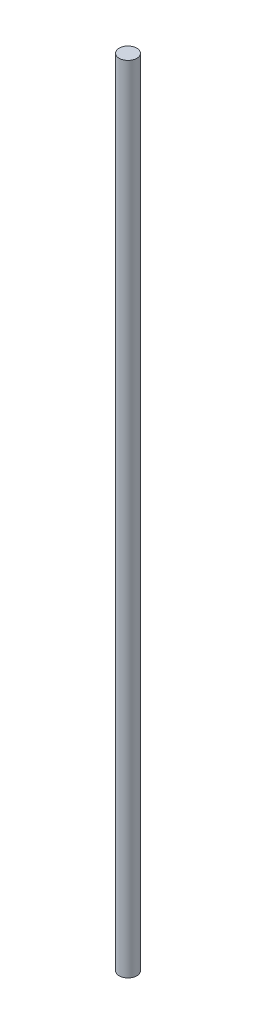
ISO-10303-21;
HEADER;
FILE_DESCRIPTION(('STEP AP214'),'2;1');
FILE_NAME('part.step','',(''),(''),'','','');
FILE_SCHEMA(('AUTOMOTIVE_DESIGN { 1 0 10303 214 1 1 1 1 }'));
ENDSEC;
DATA;
#1=APPLICATION_CONTEXT('core data for automotive mechanical design processes');
#2=APPLICATION_PROTOCOL_DEFINITION('international standard','automotive_design',2000,#1);
#3=PRODUCT_CONTEXT('',#1,'mechanical');
#4=PRODUCT('Part','Part','',(#3));
#5=PRODUCT_RELATED_PRODUCT_CATEGORY('part','',(#4));
#6=PRODUCT_DEFINITION_FORMATION('','',#4);
#7=PRODUCT_DEFINITION_CONTEXT('part definition',#1,'design');
#8=PRODUCT_DEFINITION('design','',#6,#7);
#9=PRODUCT_DEFINITION_SHAPE('','',#8);
#10=(LENGTH_UNIT() NAMED_UNIT(*) SI_UNIT(.MILLI.,.METRE.));
#11=(NAMED_UNIT(*) PLANE_ANGLE_UNIT() SI_UNIT($,.RADIAN.));
#12=(NAMED_UNIT(*) SI_UNIT($,.STERADIAN.) SOLID_ANGLE_UNIT());
#13=UNCERTAINTY_MEASURE_WITH_UNIT(LENGTH_MEASURE(1.E-05),#10,'distance_accuracy_value','');
#14=(GEOMETRIC_REPRESENTATION_CONTEXT(3) GLOBAL_UNCERTAINTY_ASSIGNED_CONTEXT((#13)) GLOBAL_UNIT_ASSIGNED_CONTEXT((#10,
#11,#12)) REPRESENTATION_CONTEXT('',''));
#15=CARTESIAN_POINT('',(0.,0.,0.));
#16=DIRECTION('',(0.,0.,1.));
#17=DIRECTION('',(1.,0.,0.));
#18=AXIS2_PLACEMENT_3D('',#15,#16,#17);
#19=CARTESIAN_POINT('',(0.,571.5,0.));
#20=DIRECTION('',(0.,-1.,0.));
#21=DIRECTION('',(0.,0.,-1.));
#22=AXIS2_PLACEMENT_3D('',#19,#20,#21);
#23=CYLINDRICAL_SURFACE('',#22,6.35);
#24=CARTESIAN_POINT('',(0.,571.5,0.));
#25=DIRECTION('',(0.,1.,0.));
#26=DIRECTION('',(0.,0.,1.));
#27=AXIS2_PLACEMENT_3D('',#24,#25,#26);
#28=CIRCLE('',#27,6.35);
#29=CARTESIAN_POINT('',(0.,571.5,6.35));
#30=VERTEX_POINT('',#29);
#31=EDGE_CURVE('E10',#30,#30,#28,.T.);
#32=ORIENTED_EDGE('',*,*,#31,.F.);
#33=EDGE_LOOP('',(#32));
#34=FACE_BOUND('',#33,.T.);
#35=CARTESIAN_POINT('',(0.,0.,0.));
#36=DIRECTION('',(0.,1.,0.));
#37=DIRECTION('',(0.,0.,1.));
#38=AXIS2_PLACEMENT_3D('',#35,#36,#37);
#39=CIRCLE('',#38,6.35);
#40=CARTESIAN_POINT('',(0.,0.,6.35));
#41=VERTEX_POINT('',#40);
#42=EDGE_CURVE('E34',#41,#41,#39,.T.);
#43=ORIENTED_EDGE('',*,*,#42,.T.);
#44=EDGE_LOOP('',(#43));
#45=FACE_BOUND('',#44,.T.);
#46=ADVANCED_FACE('F31',(#34,#45),#23,.T.);
#47=CARTESIAN_POINT('',(0.,571.5,0.));
#48=DIRECTION('',(0.,1.,0.));
#49=DIRECTION('',(0.,0.,1.));
#50=AXIS2_PLACEMENT_3D('',#47,#48,#49);
#51=PLANE('',#50);
#52=ORIENTED_EDGE('',*,*,#31,.T.);
#53=EDGE_LOOP('',(#52));
#54=FACE_BOUND('',#53,.T.);
#55=ADVANCED_FACE('F46',(#54),#51,.T.);
#56=CARTESIAN_POINT('',(0.,0.,0.));
#57=DIRECTION('',(0.,1.,0.));
#58=DIRECTION('',(0.,0.,1.));
#59=AXIS2_PLACEMENT_3D('',#56,#57,#58);
#60=PLANE('',#59);
#61=ORIENTED_EDGE('',*,*,#42,.F.);
#62=EDGE_LOOP('',(#61));
#63=FACE_BOUND('',#62,.T.);
#64=ADVANCED_FACE('F44',(#63),#60,.F.);
#65=CLOSED_SHELL('',(#46,#55,#64));
#66=MANIFOLD_SOLID_BREP('B2',#65);
#67=ADVANCED_BREP_SHAPE_REPRESENTATION('',(#18,#66),#14);
#68=SHAPE_DEFINITION_REPRESENTATION(#9,#67);
ENDSEC;
END-ISO-10303-21;
